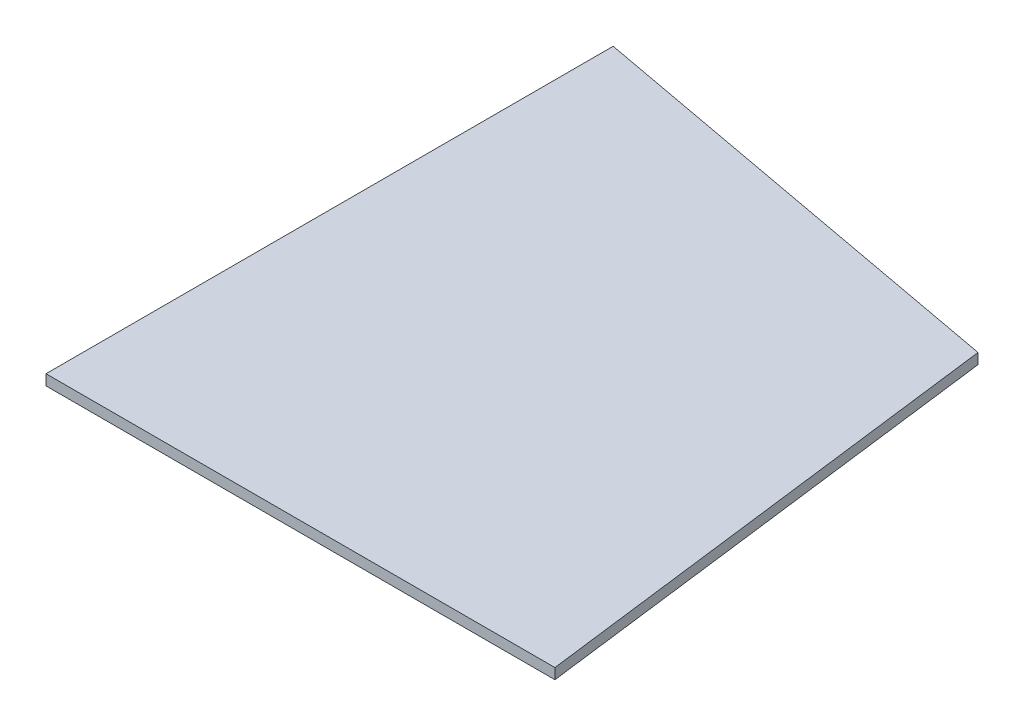
ISO-10303-21;
HEADER;
FILE_DESCRIPTION(('STEP AP214'),'2;1');
FILE_NAME('part.step','',(''),(''),'','','');
FILE_SCHEMA(('AUTOMOTIVE_DESIGN { 1 0 10303 214 1 1 1 1 }'));
ENDSEC;
DATA;
#1=APPLICATION_CONTEXT('core data for automotive mechanical design processes');
#2=APPLICATION_PROTOCOL_DEFINITION('international standard','automotive_design',2000,#1);
#3=PRODUCT_CONTEXT('',#1,'mechanical');
#4=PRODUCT('Part','Part','',(#3));
#5=PRODUCT_RELATED_PRODUCT_CATEGORY('part','',(#4));
#6=PRODUCT_DEFINITION_FORMATION('','',#4);
#7=PRODUCT_DEFINITION_CONTEXT('part definition',#1,'design');
#8=PRODUCT_DEFINITION('design','',#6,#7);
#9=PRODUCT_DEFINITION_SHAPE('','',#8);
#10=(LENGTH_UNIT() NAMED_UNIT(*) SI_UNIT(.MILLI.,.METRE.));
#11=(NAMED_UNIT(*) PLANE_ANGLE_UNIT() SI_UNIT($,.RADIAN.));
#12=(NAMED_UNIT(*) SI_UNIT($,.STERADIAN.) SOLID_ANGLE_UNIT());
#13=UNCERTAINTY_MEASURE_WITH_UNIT(LENGTH_MEASURE(1.E-05),#10,'distance_accuracy_value','');
#14=(GEOMETRIC_REPRESENTATION_CONTEXT(3) GLOBAL_UNCERTAINTY_ASSIGNED_CONTEXT((#13)) GLOBAL_UNIT_ASSIGNED_CONTEXT((#10,
#11,#12)) REPRESENTATION_CONTEXT('',''));
#15=CARTESIAN_POINT('',(0.,0.,0.));
#16=DIRECTION('',(0.,0.,1.));
#17=DIRECTION('',(1.,0.,0.));
#18=AXIS2_PLACEMENT_3D('',#15,#16,#17);
#19=CARTESIAN_POINT('',(0.,5.4737,0.));
#20=DIRECTION('',(-1.,0.,0.));
#21=DIRECTION('',(0.,0.,1.));
#22=AXIS2_PLACEMENT_3D('',#19,#20,#21);
#23=PLANE('',#22);
#24=DIRECTION('',(0.,0.,-1.));
#25=VECTOR('',#24,1.);
#26=CARTESIAN_POINT('',(0.,0.,0.));
#27=LINE('',#26,#25);
#28=CARTESIAN_POINT('',(0.,0.,0.));
#29=VERTEX_POINT('',#28);
#30=CARTESIAN_POINT('',(0.,0.,-293.6875));
#31=VERTEX_POINT('',#30);
#32=EDGE_CURVE('E98',#29,#31,#27,.T.);
#33=ORIENTED_EDGE('',*,*,#32,.F.);
#34=DIRECTION('',(0.,-1.,0.));
#35=VECTOR('',#34,1.);
#36=CARTESIAN_POINT('',(0.,5.4737,0.));
#37=LINE('',#36,#35);
#38=CARTESIAN_POINT('',(0.,5.4737,0.));
#39=VERTEX_POINT('',#38);
#40=EDGE_CURVE('E11',#39,#29,#37,.T.);
#41=ORIENTED_EDGE('',*,*,#40,.F.);
#42=DIRECTION('',(0.,0.,-1.));
#43=VECTOR('',#42,1.);
#44=CARTESIAN_POINT('',(0.,5.4737,0.));
#45=LINE('',#44,#43);
#46=CARTESIAN_POINT('',(0.,5.4737,-293.6875));
#47=VERTEX_POINT('',#46);
#48=EDGE_CURVE('E92',#39,#47,#45,.T.);
#49=ORIENTED_EDGE('',*,*,#48,.T.);
#50=DIRECTION('',(0.,-1.,0.));
#51=VECTOR('',#50,1.);
#52=CARTESIAN_POINT('',(0.,5.4737,-293.6875));
#53=LINE('',#52,#51);
#54=EDGE_CURVE('E36',#47,#31,#53,.T.);
#55=ORIENTED_EDGE('',*,*,#54,.T.);
#56=EDGE_LOOP('',(#33,#41,#49,#55));
#57=FACE_BOUND('',#56,.T.);
#58=ADVANCED_FACE('F33',(#57),#23,.T.);
#59=CARTESIAN_POINT('',(0.,5.4737,0.));
#60=DIRECTION('',(0.,0.,-1.));
#61=DIRECTION('',(-1.,0.,0.));
#62=AXIS2_PLACEMENT_3D('',#59,#60,#61);
#63=PLANE('',#62);
#64=DIRECTION('',(1.,0.,0.));
#65=VECTOR('',#64,1.);
#66=CARTESIAN_POINT('',(0.,0.,0.));
#67=LINE('',#66,#65);
#68=CARTESIAN_POINT('',(263.525,0.,0.));
#69=VERTEX_POINT('',#68);
#70=EDGE_CURVE('E94',#29,#69,#67,.T.);
#71=ORIENTED_EDGE('',*,*,#70,.T.);
#72=DIRECTION('',(0.,-1.,0.));
#73=VECTOR('',#72,1.);
#74=CARTESIAN_POINT('',(263.525,5.4737,0.));
#75=LINE('',#74,#73);
#76=CARTESIAN_POINT('',(263.525,5.4737,0.));
#77=VERTEX_POINT('',#76);
#78=EDGE_CURVE('E42',#77,#69,#75,.T.);
#79=ORIENTED_EDGE('',*,*,#78,.F.);
#80=DIRECTION('',(1.,0.,0.));
#81=VECTOR('',#80,1.);
#82=CARTESIAN_POINT('',(0.,5.4737,0.));
#83=LINE('',#82,#81);
#84=EDGE_CURVE('E89',#39,#77,#83,.T.);
#85=ORIENTED_EDGE('',*,*,#84,.F.);
#86=ORIENTED_EDGE('',*,*,#40,.T.);
#87=EDGE_LOOP('',(#71,#79,#85,#86));
#88=FACE_BOUND('',#87,.T.);
#89=ADVANCED_FACE('F105',(#88),#63,.F.);
#90=CARTESIAN_POINT('',(231.775,5.4737,-250.825));
#91=DIRECTION('',(0.992083472687499,0.,-0.125580186416139));
#92=DIRECTION('',(-0.125580186416139,0.,-0.992083472687499));
#93=AXIS2_PLACEMENT_3D('',#90,#91,#92);
#94=PLANE('',#93);
#95=DIRECTION('',(0.125580186416139,0.,0.992083472687499));
#96=VECTOR('',#95,1.);
#97=CARTESIAN_POINT('',(231.775,0.,-250.825));
#98=LINE('',#97,#96);
#99=CARTESIAN_POINT('',(231.775,0.,-250.825));
#100=VERTEX_POINT('',#99);
#101=EDGE_CURVE('E83',#100,#69,#98,.T.);
#102=ORIENTED_EDGE('',*,*,#101,.F.);
#103=DIRECTION('',(0.,-1.,0.));
#104=VECTOR('',#103,1.);
#105=CARTESIAN_POINT('',(231.775,5.4737,-250.825));
#106=LINE('',#105,#104);
#107=CARTESIAN_POINT('',(231.775,5.4737,-250.825));
#108=VERTEX_POINT('',#107);
#109=EDGE_CURVE('E78',#108,#100,#106,.T.);
#110=ORIENTED_EDGE('',*,*,#109,.F.);
#111=DIRECTION('',(0.125580186416139,0.,0.992083472687499));
#112=VECTOR('',#111,1.);
#113=CARTESIAN_POINT('',(231.775,5.4737,-250.825));
#114=LINE('',#113,#112);
#115=EDGE_CURVE('E81',#108,#77,#114,.T.);
#116=ORIENTED_EDGE('',*,*,#115,.T.);
#117=ORIENTED_EDGE('',*,*,#78,.T.);
#118=EDGE_LOOP('',(#102,#110,#116,#117));
#119=FACE_BOUND('',#118,.T.);
#120=ADVANCED_FACE('F80',(#119),#94,.T.);
#121=CARTESIAN_POINT('',(0.,5.4737,-293.6875));
#122=DIRECTION('',(0.181848076884126,0.,-0.983326637966014));
#123=DIRECTION('',(-0.983326637966014,0.,-0.181848076884126));
#124=AXIS2_PLACEMENT_3D('',#121,#122,#123);
#125=PLANE('',#124);
#126=DIRECTION('',(0.983326637966014,0.,0.181848076884126));
#127=VECTOR('',#126,1.);
#128=CARTESIAN_POINT('',(0.,0.,-293.6875));
#129=LINE('',#128,#127);
#130=EDGE_CURVE('E101',#31,#100,#129,.T.);
#131=ORIENTED_EDGE('',*,*,#130,.F.);
#132=ORIENTED_EDGE('',*,*,#54,.F.);
#133=DIRECTION('',(0.983326637966014,0.,0.181848076884126));
#134=VECTOR('',#133,1.);
#135=CARTESIAN_POINT('',(0.,5.4737,-293.6875));
#136=LINE('',#135,#134);
#137=EDGE_CURVE('E88',#47,#108,#136,.T.);
#138=ORIENTED_EDGE('',*,*,#137,.T.);
#139=ORIENTED_EDGE('',*,*,#109,.T.);
#140=EDGE_LOOP('',(#131,#132,#138,#139));
#141=FACE_BOUND('',#140,.T.);
#142=ADVANCED_FACE('F91',(#141),#125,.T.);
#143=CARTESIAN_POINT('',(0.,5.4737,0.));
#144=DIRECTION('',(0.,-1.,0.));
#145=DIRECTION('',(0.,0.,-1.));
#146=AXIS2_PLACEMENT_3D('',#143,#144,#145);
#147=PLANE('',#146);
#148=ORIENTED_EDGE('',*,*,#48,.F.);
#149=ORIENTED_EDGE('',*,*,#84,.T.);
#150=ORIENTED_EDGE('',*,*,#115,.F.);
#151=ORIENTED_EDGE('',*,*,#137,.F.);
#152=EDGE_LOOP('',(#148,#149,#150,#151));
#153=FACE_BOUND('',#152,.T.);
#154=ADVANCED_FACE('F87',(#153),#147,.F.);
#155=CARTESIAN_POINT('',(0.,0.,0.));
#156=DIRECTION('',(0.,-1.,0.));
#157=DIRECTION('',(0.,0.,-1.));
#158=AXIS2_PLACEMENT_3D('',#155,#156,#157);
#159=PLANE('',#158);
#160=ORIENTED_EDGE('',*,*,#32,.T.);
#161=ORIENTED_EDGE('',*,*,#130,.T.);
#162=ORIENTED_EDGE('',*,*,#101,.T.);
#163=ORIENTED_EDGE('',*,*,#70,.F.);
#164=EDGE_LOOP('',(#160,#161,#162,#163));
#165=FACE_BOUND('',#164,.T.);
#166=ADVANCED_FACE('F107',(#165),#159,.T.);
#167=CLOSED_SHELL('',(#58,#89,#120,#142,#154,#166));
#168=MANIFOLD_SOLID_BREP('B2',#167);
#169=ADVANCED_BREP_SHAPE_REPRESENTATION('',(#18,#168),#14);
#170=SHAPE_DEFINITION_REPRESENTATION(#9,#169);
ENDSEC;
END-ISO-10303-21;
